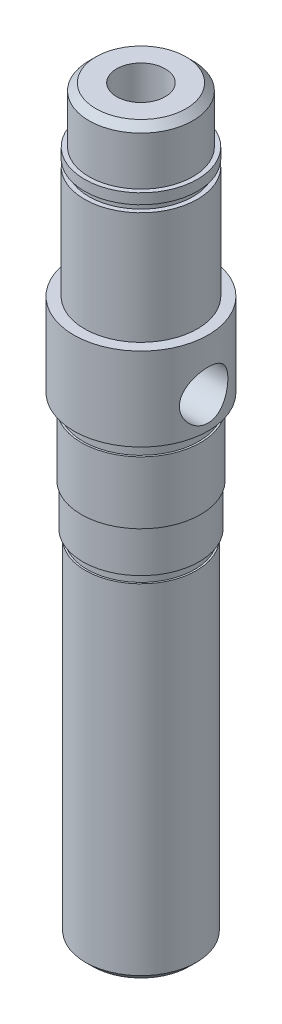
ISO-10303-21;
HEADER;
FILE_DESCRIPTION(('STEP AP214'),'2;1');
FILE_NAME('part.step','',(''),(''),'','','');
FILE_SCHEMA(('AUTOMOTIVE_DESIGN { 1 0 10303 214 1 1 1 1 }'));
ENDSEC;
DATA;
#1=APPLICATION_CONTEXT('core data for automotive mechanical design processes');
#2=APPLICATION_PROTOCOL_DEFINITION('international standard','automotive_design',2000,#1);
#3=PRODUCT_CONTEXT('',#1,'mechanical');
#4=PRODUCT('Part','Part','',(#3));
#5=PRODUCT_RELATED_PRODUCT_CATEGORY('part','',(#4));
#6=PRODUCT_DEFINITION_FORMATION('','',#4);
#7=PRODUCT_DEFINITION_CONTEXT('part definition',#1,'design');
#8=PRODUCT_DEFINITION('design','',#6,#7);
#9=PRODUCT_DEFINITION_SHAPE('','',#8);
#10=(LENGTH_UNIT() NAMED_UNIT(*) SI_UNIT(.MILLI.,.METRE.));
#11=(NAMED_UNIT(*) PLANE_ANGLE_UNIT() SI_UNIT($,.RADIAN.));
#12=(NAMED_UNIT(*) SI_UNIT($,.STERADIAN.) SOLID_ANGLE_UNIT());
#13=UNCERTAINTY_MEASURE_WITH_UNIT(LENGTH_MEASURE(1.E-05),#10,'distance_accuracy_value','');
#14=(GEOMETRIC_REPRESENTATION_CONTEXT(3) GLOBAL_UNCERTAINTY_ASSIGNED_CONTEXT((#13)) GLOBAL_UNIT_ASSIGNED_CONTEXT((#10,
#11,#12)) REPRESENTATION_CONTEXT('',''));
#15=CARTESIAN_POINT('',(0.,0.,0.));
#16=DIRECTION('',(0.,0.,1.));
#17=DIRECTION('',(1.,0.,0.));
#18=AXIS2_PLACEMENT_3D('',#15,#16,#17);
#19=CARTESIAN_POINT('',(0.,107.,0.));
#20=DIRECTION('',(0.,1.,0.));
#21=DIRECTION('',(0.,0.,1.));
#22=AXIS2_PLACEMENT_3D('',#19,#20,#21);
#23=CYLINDRICAL_SURFACE('',#22,9.7);
#24=CARTESIAN_POINT('',(0.,68.3,0.));
#25=DIRECTION('',(0.,1.,0.));
#26=DIRECTION('',(0.,0.,1.));
#27=AXIS2_PLACEMENT_3D('',#24,#25,#26);
#28=CIRCLE('',#27,9.7);
#29=CARTESIAN_POINT('',(0.,68.3,9.7));
#30=VERTEX_POINT('',#29);
#31=EDGE_CURVE('E125',#30,#30,#28,.T.);
#32=ORIENTED_EDGE('',*,*,#31,.T.);
#33=EDGE_LOOP('',(#32));
#34=FACE_BOUND('',#33,.T.);
#35=CARTESIAN_POINT('',(0.,80.3,0.));
#36=DIRECTION('',(0.,1.,0.));
#37=DIRECTION('',(0.,0.,1.));
#38=AXIS2_PLACEMENT_3D('',#35,#36,#37);
#39=CIRCLE('',#38,9.7);
#40=CARTESIAN_POINT('',(0.,80.3,9.7));
#41=VERTEX_POINT('',#40);
#42=EDGE_CURVE('E122',#41,#41,#39,.T.);
#43=ORIENTED_EDGE('',*,*,#42,.F.);
#44=EDGE_LOOP('',(#43));
#45=FACE_BOUND('',#44,.T.);
#46=CARTESIAN_POINT('',(9.7,76.3,0.));
#47=CARTESIAN_POINT('',(9.70000326363208,76.3000044955306,-0.190048434312413));
#48=CARTESIAN_POINT('',(9.69436502310496,76.2844715213943,-0.380065060738042));
#49=CARTESIAN_POINT('',(9.67243340114104,76.2229796151586,-0.754447520469261));
#50=CARTESIAN_POINT('',(9.6561406602026,76.1770225120126,-0.938813692756118));
#51=CARTESIAN_POINT('',(9.61465656297397,76.056500360991,-1.29644341601968));
#52=CARTESIAN_POINT('',(9.58948158703399,75.9819879522946,-1.46972671546527));
#53=CARTESIAN_POINT('',(9.53276201569288,75.8067276163716,-1.80132810228594));
#54=CARTESIAN_POINT('',(9.50121585549874,75.7059732422301,-1.95964249917633));
#55=CARTESIAN_POINT('',(9.43363084003839,75.4768963511195,-2.26310684130997));
#56=CARTESIAN_POINT('',(9.39747147835585,75.347715125354,-2.40758151312234));
#57=CARTESIAN_POINT('',(9.32535229272255,75.0672750043416,-2.67335049376495));
#58=CARTESIAN_POINT('',(9.2893925260619,74.9160100793378,-2.79463845071457));
#59=CARTESIAN_POINT('',(9.22036932494171,74.589282473392,-3.01472760920259));
#60=CARTESIAN_POINT('',(9.18744978930663,74.4131620197553,-3.11260192105112));
#61=CARTESIAN_POINT('',(9.13009434964343,74.0455830371819,-3.27704413538523));
#62=CARTESIAN_POINT('',(9.10565534320794,73.8541301488788,-3.3436234895813));
#63=CARTESIAN_POINT('',(9.06930945422295,73.4690659544289,-3.44096614767453));
#64=CARTESIAN_POINT('',(9.05695599489681,73.2758220280291,-3.47301058915794));
#65=CARTESIAN_POINT('',(9.04486769860813,72.8863354900277,-3.50437996520875));
#66=CARTESIAN_POINT('',(9.04512813440671,72.6900940293584,-3.50371715728725));
#67=CARTESIAN_POINT('',(9.05785091249404,72.3116123435047,-3.47067569177911));
#68=CARTESIAN_POINT('',(9.06964442029104,72.1291937963775,-3.44003546231126));
#69=CARTESIAN_POINT('',(9.10299899622594,71.7722866266259,-3.3507694420784));
#70=CARTESIAN_POINT('',(9.12456142579761,71.5977991130309,-3.2921397505352));
#71=CARTESIAN_POINT('',(9.17545236904553,71.2580223962428,-3.14754158601287));
#72=CARTESIAN_POINT('',(9.20491367715409,71.0929552769824,-3.06110004294575));
#73=CARTESIAN_POINT('',(9.26823458396981,70.7791489752728,-2.86366099099152));
#74=CARTESIAN_POINT('',(9.30209561736307,70.6304151481907,-2.75265546381061));
#75=CARTESIAN_POINT('',(9.37295773274056,70.3438211342941,-2.50114692866622));
#76=CARTESIAN_POINT('',(9.41002348969878,70.2072025711136,-2.35924408032947));
#77=CARTESIAN_POINT('',(9.48130712611506,69.9593480232088,-2.05410244545163));
#78=CARTESIAN_POINT('',(9.51552463005577,69.8481153820406,-1.8908608528525));
#79=CARTESIAN_POINT('',(9.57784962624326,69.6529549876507,-1.54469787396443));
#80=CARTESIAN_POINT('',(9.60586933384917,69.5694120859784,-1.36154259916851));
#81=CARTESIAN_POINT('',(9.65199610066544,69.4347270107282,-0.982517762074592));
#82=CARTESIAN_POINT('',(9.67010722221703,69.383571557527,-0.786653447150329));
#83=CARTESIAN_POINT('',(9.69367649897002,69.3174340921615,-0.398241992693978));
#84=CARTESIAN_POINT('',(9.69971962647188,69.3007781665351,-0.206015067332783));
#85=CARTESIAN_POINT('',(9.70026094381358,69.2992756819393,0.178558142724519));
#86=CARTESIAN_POINT('',(9.69476147121017,69.314422682381,0.370904395368631));
#87=CARTESIAN_POINT('',(9.67322206396606,69.374803917233,0.743211618243393));
#88=CARTESIAN_POINT('',(9.65755795448175,69.4189660526467,0.923370432152372));
#89=CARTESIAN_POINT('',(9.6176399859743,69.5347375623733,1.27361485837229));
#90=CARTESIAN_POINT('',(9.59338501042671,69.6063505044701,1.44369915797884));
#91=CARTESIAN_POINT('',(9.53784534991105,69.7772213099272,1.77438230731065));
#92=CARTESIAN_POINT('',(9.50638018857487,69.8772081797726,1.93457324534963));
#93=CARTESIAN_POINT('',(9.43993371175233,70.1011541230601,2.23642059530887));
#94=CARTESIAN_POINT('',(9.40495117244505,70.2251215541498,2.37807051641664));
#95=CARTESIAN_POINT('',(9.33301253255255,70.501344890552,2.64674498418307));
#96=CARTESIAN_POINT('',(9.29605117578761,70.6547611009922,2.77257826584955));
#97=CARTESIAN_POINT('',(9.22617619324352,70.9812880031909,2.99691853154221));
#98=CARTESIAN_POINT('',(9.19326279613658,71.1543998065053,3.09542397219298));
#99=CARTESIAN_POINT('',(9.13542619130016,71.5162931309494,3.26218250914122));
#100=CARTESIAN_POINT('',(9.11051622041164,71.7050999676196,3.33038555899287));
#101=CARTESIAN_POINT('',(9.07211527346371,72.0926547206841,3.43363039976507));
#102=CARTESIAN_POINT('',(9.05861793659507,72.2913970340502,3.46869066403966));
#103=CARTESIAN_POINT('',(9.04537391578975,72.680382531402,3.50307251896356));
#104=CARTESIAN_POINT('',(9.04485315408342,72.8704231827226,3.50440605027261));
#105=CARTESIAN_POINT('',(9.05566130946437,73.2478661626803,3.47638016301811));
#106=CARTESIAN_POINT('',(9.06698926615892,73.4352687039005,3.44702323205678));
#107=CARTESIAN_POINT('',(9.09959684074913,73.7971741890099,3.35996972486521));
#108=CARTESIAN_POINT('',(9.12060861050414,73.9718862678548,3.3030339253056));
#109=CARTESIAN_POINT('',(9.1700792819177,74.3093939457707,3.16308828400569));
#110=CARTESIAN_POINT('',(9.19853999491781,74.4721866340935,3.08007209937613));
#111=CARTESIAN_POINT('',(9.26145596420581,74.7899862946857,2.88554358646493));
#112=CARTESIAN_POINT('',(9.29613822299486,74.9442089274945,2.77282405541366));
#113=CARTESIAN_POINT('',(9.36675222929969,75.2321957811959,2.52401650801083));
#114=CARTESIAN_POINT('',(9.40268435591504,75.3659537273147,2.38792135139043));
#115=CARTESIAN_POINT('',(9.47384591335729,75.6158145326139,2.08831076460616));
#116=CARTESIAN_POINT('',(9.5089564254182,75.7307441726914,1.92378450733773));
#117=CARTESIAN_POINT('',(9.57265097937597,75.9312473439185,1.57653817122));
#118=CARTESIAN_POINT('',(9.60123531746125,76.0168222074143,1.39381891859498));
#119=CARTESIAN_POINT('',(9.64889832770736,76.1564301569307,1.01291303744514));
#120=CARTESIAN_POINT('',(9.66785793269195,76.2100695080788,0.814566153396514));
#121=CARTESIAN_POINT('',(9.69340446232499,76.2818447031419,0.410798501658297));
#122=CARTESIAN_POINT('',(9.69999647307293,76.2999951417905,0.205380677258914));
#123=CARTESIAN_POINT('',(9.7,76.3,0.));
#124=B_SPLINE_CURVE_WITH_KNOTS('',3,(#46,#47,#48,#49,#50,#51,#52,#53,#54,#55,#56,#57,#58,#59,
#60,#61,#62,#63,#64,#65,#66,#67,#68,#69,#70,#71,#72,#73,#74,#75,#76,#77,#78,#79,#80,#81,#82,#83,
#84,#85,#86,#87,#88,#89,#90,#91,#92,#93,#94,#95,#96,#97,#98,#99,#100,#101,#102,#103,#104,#105,
#106,#107,#108,#109,#110,#111,#112,#113,#114,#115,#116,#117,#118,#119,#120,#121,#122,#123),
.UNSPECIFIED.,.T.,.F.,(4,2,2,2,2,2,2,2,2,2,2,2,2,2,2,2,2,2,2,2,2,2,2,2,2,2,2,2,2,2,2,2,2,2,2,2,
2,2,4),(0.,0.569388345410459,1.13874246502282,1.70705204038071,2.27550136537242,
2.86432632019842,3.45331235015006,4.06274682276192,4.67195811210805,5.25769676297937,
5.8432159015532,6.39667789415568,6.95021704304686,7.51371919542262,8.07740556093055,
8.67595822456505,9.27458967757422,9.88122288759437,10.4876072022281,11.063806383537,
11.639888886775,12.1957994262361,12.7517822419501,13.3235939071889,13.8956052190755,
14.4982838272857,15.1009964656292,15.704700857624,16.3080685539524,16.8753520908334,
17.4425896503562,17.995001162535,18.5475471282925,19.1274455926038,19.7075215075113,
20.315774937114,20.9240007558306,21.539577970193,22.1549019765539),.UNSPECIFIED.);
#125=CARTESIAN_POINT('',(9.7,76.3,0.));
#126=VERTEX_POINT('',#125);
#127=EDGE_CURVE('E165',#126,#126,#124,.T.);
#128=ORIENTED_EDGE('',*,*,#127,.T.);
#129=EDGE_LOOP('',(#128));
#130=FACE_BOUND('',#129,.T.);
#131=ADVANCED_FACE('F41',(#34,#45,#130),#23,.T.);
#132=CARTESIAN_POINT('',(0.,0.,0.));
#133=DIRECTION('',(0.,-1.,0.));
#134=DIRECTION('',(0.,0.,-1.));
#135=AXIS2_PLACEMENT_3D('',#132,#133,#134);
#136=PLANE('',#135);
#137=CARTESIAN_POINT('',(0.,0.,0.));
#138=DIRECTION('',(0.,-1.,0.));
#139=DIRECTION('',(0.,0.,-1.));
#140=AXIS2_PLACEMENT_3D('',#137,#138,#139);
#141=CIRCLE('',#140,4.49999999999999);
#142=CARTESIAN_POINT('',(0.,0.,-4.49999999999999));
#143=VERTEX_POINT('',#142);
#144=EDGE_CURVE('E11',#143,#143,#141,.F.);
#145=ORIENTED_EDGE('',*,*,#144,.T.);
#146=EDGE_LOOP('',(#145));
#147=FACE_BOUND('',#146,.T.);
#148=CARTESIAN_POINT('',(0.,0.,0.));
#149=DIRECTION('',(0.,1.,0.));
#150=DIRECTION('',(0.,0.,1.));
#151=AXIS2_PLACEMENT_3D('',#148,#149,#150);
#152=CIRCLE('',#151,7.);
#153=CARTESIAN_POINT('',(0.,0.,7.));
#154=VERTEX_POINT('',#153);
#155=EDGE_CURVE('E158',#154,#154,#152,.T.);
#156=ORIENTED_EDGE('',*,*,#155,.F.);
#157=EDGE_LOOP('',(#156));
#158=FACE_BOUND('',#157,.T.);
#159=ADVANCED_FACE('F236',(#147,#158),#136,.T.);
#160=CARTESIAN_POINT('',(0.,1.,0.));
#161=DIRECTION('',(0.,1.,0.));
#162=DIRECTION('',(0.,0.,1.));
#163=AXIS2_PLACEMENT_3D('',#160,#161,#162);
#164=CONICAL_SURFACE('',#163,8.00000000000003,0.78539816339746);
#165=ORIENTED_EDGE('',*,*,#155,.T.);
#166=EDGE_LOOP('',(#165));
#167=FACE_BOUND('',#166,.T.);
#168=CARTESIAN_POINT('',(0.,1.,0.));
#169=DIRECTION('',(0.,1.,0.));
#170=DIRECTION('',(0.,0.,1.));
#171=AXIS2_PLACEMENT_3D('',#168,#169,#170);
#172=CIRCLE('',#171,8.00000000000003);
#173=CARTESIAN_POINT('',(0.,1.,8.00000000000003));
#174=VERTEX_POINT('',#173);
#175=EDGE_CURVE('E155',#174,#174,#172,.T.);
#176=ORIENTED_EDGE('',*,*,#175,.F.);
#177=EDGE_LOOP('',(#176));
#178=FACE_BOUND('',#177,.T.);
#179=ADVANCED_FACE('F241',(#167,#178),#164,.T.);
#180=CARTESIAN_POINT('',(0.,107.,0.));
#181=DIRECTION('',(0.,1.,0.));
#182=DIRECTION('',(0.,0.,1.));
#183=AXIS2_PLACEMENT_3D('',#180,#181,#182);
#184=CYLINDRICAL_SURFACE('',#183,8.00000000000003);
#185=CARTESIAN_POINT('',(0.,2.69999999999999,0.));
#186=DIRECTION('',(0.,-1.,0.));
#187=DIRECTION('',(0.,0.,-1.));
#188=AXIS2_PLACEMENT_3D('',#185,#186,#187);
#189=CIRCLE('',#188,8.00000000000003);
#190=CARTESIAN_POINT('',(5.80947501931,2.7,-5.5));
#191=VERTEX_POINT('',#190);
#192=CARTESIAN_POINT('',(-5.80947501931116,2.70000000000001,-5.5));
#193=VERTEX_POINT('',#192);
#194=EDGE_CURVE('E163',#191,#193,#189,.F.);
#195=ORIENTED_EDGE('',*,*,#194,.F.);
#196=DIRECTION('',(0.,1.,0.));
#197=VECTOR('',#196,1.);
#198=CARTESIAN_POINT('',(5.80947501931,2.7,-5.5));
#199=LINE('',#198,#197);
#200=CARTESIAN_POINT('',(5.80947501931,47.1,-5.5));
#201=VERTEX_POINT('',#200);
#202=EDGE_CURVE('E87',#191,#201,#199,.T.);
#203=ORIENTED_EDGE('',*,*,#202,.T.);
#204=CARTESIAN_POINT('',(0.,47.1,0.));
#205=DIRECTION('',(0.,1.,0.));
#206=DIRECTION('',(0.,0.,1.));
#207=AXIS2_PLACEMENT_3D('',#204,#205,#206);
#208=CIRCLE('',#207,8.00000000000003);
#209=CARTESIAN_POINT('',(-5.80947501931,47.1,-5.5));
#210=VERTEX_POINT('',#209);
#211=EDGE_CURVE('E161',#210,#201,#208,.F.);
#212=ORIENTED_EDGE('',*,*,#211,.F.);
#213=DIRECTION('',(0.,-1.,0.));
#214=VECTOR('',#213,1.);
#215=CARTESIAN_POINT('',(-5.80947501931,47.1,-5.5));
#216=LINE('',#215,#214);
#217=EDGE_CURVE('E92',#210,#193,#216,.T.);
#218=ORIENTED_EDGE('',*,*,#217,.T.);
#219=EDGE_LOOP('',(#195,#203,#212,#218));
#220=FACE_BOUND('',#219,.T.);
#221=ORIENTED_EDGE('',*,*,#175,.T.);
#222=EDGE_LOOP('',(#221));
#223=FACE_BOUND('',#222,.T.);
#224=CARTESIAN_POINT('',(0.,50.,0.));
#225=DIRECTION('',(0.,1.,0.));
#226=DIRECTION('',(0.,0.,1.));
#227=AXIS2_PLACEMENT_3D('',#224,#225,#226);
#228=CIRCLE('',#227,8.00000000000003);
#229=CARTESIAN_POINT('',(0.,50.,8.00000000000003));
#230=VERTEX_POINT('',#229);
#231=EDGE_CURVE('E152',#230,#230,#228,.T.);
#232=ORIENTED_EDGE('',*,*,#231,.F.);
#233=EDGE_LOOP('',(#232));
#234=FACE_BOUND('',#233,.T.);
#235=ADVANCED_FACE('F253',(#220,#223,#234),#184,.T.);
#236=CARTESIAN_POINT('',(-8.00000000000003,50.,0.));
#237=DIRECTION('',(0.,1.,0.));
#238=DIRECTION('',(0.,0.,1.));
#239=AXIS2_PLACEMENT_3D('',#236,#237,#238);
#240=PLANE('',#239);
#241=ORIENTED_EDGE('',*,*,#231,.T.);
#242=EDGE_LOOP('',(#241));
#243=FACE_BOUND('',#242,.T.);
#244=CARTESIAN_POINT('',(0.,50.,0.));
#245=DIRECTION('',(0.,1.,0.));
#246=DIRECTION('',(0.,0.,1.));
#247=AXIS2_PLACEMENT_3D('',#244,#245,#246);
#248=CIRCLE('',#247,7.75000000000003);
#249=CARTESIAN_POINT('',(0.,50.,7.75000000000003));
#250=VERTEX_POINT('',#249);
#251=EDGE_CURVE('E149',#250,#250,#248,.T.);
#252=ORIENTED_EDGE('',*,*,#251,.F.);
#253=EDGE_LOOP('',(#252));
#254=FACE_BOUND('',#253,.T.);
#255=ADVANCED_FACE('F260',(#243,#254),#240,.T.);
#256=CARTESIAN_POINT('',(0.,107.,0.));
#257=DIRECTION('',(0.,1.,0.));
#258=DIRECTION('',(0.,0.,1.));
#259=AXIS2_PLACEMENT_3D('',#256,#257,#258);
#260=CYLINDRICAL_SURFACE('',#259,7.75000000000003);
#261=ORIENTED_EDGE('',*,*,#251,.T.);
#262=EDGE_LOOP('',(#261));
#263=FACE_BOUND('',#262,.T.);
#264=CARTESIAN_POINT('',(0.,51.3,0.));
#265=DIRECTION('',(0.,1.,0.));
#266=DIRECTION('',(0.,0.,1.));
#267=AXIS2_PLACEMENT_3D('',#264,#265,#266);
#268=CIRCLE('',#267,7.75000000000003);
#269=CARTESIAN_POINT('',(0.,51.3,7.75000000000003));
#270=VERTEX_POINT('',#269);
#271=EDGE_CURVE('E146',#270,#270,#268,.T.);
#272=ORIENTED_EDGE('',*,*,#271,.F.);
#273=EDGE_LOOP('',(#272));
#274=FACE_BOUND('',#273,.T.);
#275=ADVANCED_FACE('F264',(#263,#274),#260,.T.);
#276=CARTESIAN_POINT('',(-7.75000000000003,51.3,0.));
#277=DIRECTION('',(0.,-1.,0.));
#278=DIRECTION('',(0.,0.,-1.));
#279=AXIS2_PLACEMENT_3D('',#276,#277,#278);
#280=PLANE('',#279);
#281=ORIENTED_EDGE('',*,*,#271,.T.);
#282=EDGE_LOOP('',(#281));
#283=FACE_BOUND('',#282,.T.);
#284=CARTESIAN_POINT('',(0.,51.3,0.));
#285=DIRECTION('',(0.,1.,0.));
#286=DIRECTION('',(0.,0.,1.));
#287=AXIS2_PLACEMENT_3D('',#284,#285,#286);
#288=CIRCLE('',#287,8.40000000000003);
#289=CARTESIAN_POINT('',(0.,51.3,8.40000000000003));
#290=VERTEX_POINT('',#289);
#291=EDGE_CURVE('E143',#290,#290,#288,.T.);
#292=ORIENTED_EDGE('',*,*,#291,.F.);
#293=EDGE_LOOP('',(#292));
#294=FACE_BOUND('',#293,.T.);
#295=ADVANCED_FACE('F268',(#283,#294),#280,.T.);
#296=CARTESIAN_POINT('',(0.,107.,0.));
#297=DIRECTION('',(0.,1.,0.));
#298=DIRECTION('',(0.,0.,1.));
#299=AXIS2_PLACEMENT_3D('',#296,#297,#298);
#300=CYLINDRICAL_SURFACE('',#299,8.40000000000001);
#301=ORIENTED_EDGE('',*,*,#291,.T.);
#302=EDGE_LOOP('',(#301));
#303=FACE_BOUND('',#302,.T.);
#304=CARTESIAN_POINT('',(0.,57.3,0.));
#305=DIRECTION('',(0.,1.,0.));
#306=DIRECTION('',(0.,0.,1.));
#307=AXIS2_PLACEMENT_3D('',#304,#305,#306);
#308=CIRCLE('',#307,8.39999999999999);
#309=CARTESIAN_POINT('',(0.,57.3,8.39999999999999));
#310=VERTEX_POINT('',#309);
#311=EDGE_CURVE('E140',#310,#310,#308,.T.);
#312=ORIENTED_EDGE('',*,*,#311,.F.);
#313=EDGE_LOOP('',(#312));
#314=FACE_BOUND('',#313,.T.);
#315=ADVANCED_FACE('F272',(#303,#314),#300,.T.);
#316=CARTESIAN_POINT('',(-8.39999999999999,57.3,0.));
#317=DIRECTION('',(0.,-1.,0.));
#318=DIRECTION('',(0.,0.,-1.));
#319=AXIS2_PLACEMENT_3D('',#316,#317,#318);
#320=PLANE('',#319);
#321=ORIENTED_EDGE('',*,*,#311,.T.);
#322=EDGE_LOOP('',(#321));
#323=FACE_BOUND('',#322,.T.);
#324=CARTESIAN_POINT('',(0.,57.3,0.));
#325=DIRECTION('',(0.,1.,0.));
#326=DIRECTION('',(0.,0.,1.));
#327=AXIS2_PLACEMENT_3D('',#324,#325,#326);
#328=CIRCLE('',#327,8.59999999999999);
#329=CARTESIAN_POINT('',(0.,57.3,8.59999999999999));
#330=VERTEX_POINT('',#329);
#331=EDGE_CURVE('E137',#330,#330,#328,.T.);
#332=ORIENTED_EDGE('',*,*,#331,.F.);
#333=EDGE_LOOP('',(#332));
#334=FACE_BOUND('',#333,.T.);
#335=ADVANCED_FACE('F276',(#323,#334),#320,.T.);
#336=CARTESIAN_POINT('',(0.,107.,0.));
#337=DIRECTION('',(0.,1.,0.));
#338=DIRECTION('',(0.,0.,1.));
#339=AXIS2_PLACEMENT_3D('',#336,#337,#338);
#340=CYLINDRICAL_SURFACE('',#339,8.59999999999999);
#341=ORIENTED_EDGE('',*,*,#331,.T.);
#342=EDGE_LOOP('',(#341));
#343=FACE_BOUND('',#342,.T.);
#344=CARTESIAN_POINT('',(0.,66.3,0.));
#345=DIRECTION('',(0.,1.,0.));
#346=DIRECTION('',(0.,0.,1.));
#347=AXIS2_PLACEMENT_3D('',#344,#345,#346);
#348=CIRCLE('',#347,8.59999999999999);
#349=CARTESIAN_POINT('',(0.,66.3,8.59999999999999));
#350=VERTEX_POINT('',#349);
#351=EDGE_CURVE('E134',#350,#350,#348,.T.);
#352=ORIENTED_EDGE('',*,*,#351,.F.);
#353=EDGE_LOOP('',(#352));
#354=FACE_BOUND('',#353,.T.);
#355=ADVANCED_FACE('F280',(#343,#354),#340,.T.);
#356=CARTESIAN_POINT('',(-8.59999999999999,66.3,0.));
#357=DIRECTION('',(0.,1.,0.));
#358=DIRECTION('',(0.,0.,1.));
#359=AXIS2_PLACEMENT_3D('',#356,#357,#358);
#360=PLANE('',#359);
#361=ORIENTED_EDGE('',*,*,#351,.T.);
#362=EDGE_LOOP('',(#361));
#363=FACE_BOUND('',#362,.T.);
#364=CARTESIAN_POINT('',(0.,66.3,0.));
#365=DIRECTION('',(0.,1.,0.));
#366=DIRECTION('',(0.,0.,1.));
#367=AXIS2_PLACEMENT_3D('',#364,#365,#366);
#368=CIRCLE('',#367,8.32999999999999);
#369=CARTESIAN_POINT('',(0.,66.3,8.32999999999999));
#370=VERTEX_POINT('',#369);
#371=EDGE_CURVE('E131',#370,#370,#368,.T.);
#372=ORIENTED_EDGE('',*,*,#371,.F.);
#373=EDGE_LOOP('',(#372));
#374=FACE_BOUND('',#373,.T.);
#375=ADVANCED_FACE('F284',(#363,#374),#360,.T.);
#376=CARTESIAN_POINT('',(0.,107.,0.));
#377=DIRECTION('',(0.,1.,0.));
#378=DIRECTION('',(0.,0.,1.));
#379=AXIS2_PLACEMENT_3D('',#376,#377,#378);
#380=CYLINDRICAL_SURFACE('',#379,8.32999999999999);
#381=ORIENTED_EDGE('',*,*,#371,.T.);
#382=EDGE_LOOP('',(#381));
#383=FACE_BOUND('',#382,.T.);
#384=CARTESIAN_POINT('',(0.,68.3,0.));
#385=DIRECTION('',(0.,1.,0.));
#386=DIRECTION('',(0.,0.,1.));
#387=AXIS2_PLACEMENT_3D('',#384,#385,#386);
#388=CIRCLE('',#387,8.32999999999999);
#389=CARTESIAN_POINT('',(0.,68.3,8.32999999999999));
#390=VERTEX_POINT('',#389);
#391=EDGE_CURVE('E128',#390,#390,#388,.T.);
#392=ORIENTED_EDGE('',*,*,#391,.F.);
#393=EDGE_LOOP('',(#392));
#394=FACE_BOUND('',#393,.T.);
#395=ADVANCED_FACE('F232',(#383,#394),#380,.T.);
#396=CARTESIAN_POINT('',(-8.32999999999999,68.3,0.));
#397=DIRECTION('',(0.,-1.,0.));
#398=DIRECTION('',(0.,0.,-1.));
#399=AXIS2_PLACEMENT_3D('',#396,#397,#398);
#400=PLANE('',#399);
#401=ORIENTED_EDGE('',*,*,#391,.T.);
#402=EDGE_LOOP('',(#401));
#403=FACE_BOUND('',#402,.T.);
#404=ORIENTED_EDGE('',*,*,#31,.F.);
#405=EDGE_LOOP('',(#404));
#406=FACE_BOUND('',#405,.T.);
#407=ADVANCED_FACE('F227',(#403,#406),#400,.T.);
#408=CARTESIAN_POINT('',(-9.7,80.3,0.));
#409=DIRECTION('',(0.,1.,0.));
#410=DIRECTION('',(0.,0.,1.));
#411=AXIS2_PLACEMENT_3D('',#408,#409,#410);
#412=PLANE('',#411);
#413=ORIENTED_EDGE('',*,*,#42,.T.);
#414=EDGE_LOOP('',(#413));
#415=FACE_BOUND('',#414,.T.);
#416=CARTESIAN_POINT('',(0.,80.3,0.));
#417=DIRECTION('',(0.,1.,0.));
#418=DIRECTION('',(0.,0.,1.));
#419=AXIS2_PLACEMENT_3D('',#416,#417,#418);
#420=CIRCLE('',#419,8.15);
#421=CARTESIAN_POINT('',(0.,80.3,8.15));
#422=VERTEX_POINT('',#421);
#423=EDGE_CURVE('E119',#422,#422,#420,.T.);
#424=ORIENTED_EDGE('',*,*,#423,.F.);
#425=EDGE_LOOP('',(#424));
#426=FACE_BOUND('',#425,.T.);
#427=ADVANCED_FACE('F224',(#415,#426),#412,.T.);
#428=CARTESIAN_POINT('',(0.,107.,0.));
#429=DIRECTION('',(0.,1.,0.));
#430=DIRECTION('',(0.,0.,1.));
#431=AXIS2_PLACEMENT_3D('',#428,#429,#430);
#432=CYLINDRICAL_SURFACE('',#431,8.15);
#433=ORIENTED_EDGE('',*,*,#423,.T.);
#434=EDGE_LOOP('',(#433));
#435=FACE_BOUND('',#434,.T.);
#436=CARTESIAN_POINT('',(0.,96.5,0.));
#437=DIRECTION('',(0.,1.,0.));
#438=DIRECTION('',(0.,0.,1.));
#439=AXIS2_PLACEMENT_3D('',#436,#437,#438);
#440=CIRCLE('',#439,8.15);
#441=CARTESIAN_POINT('',(0.,96.5,8.15));
#442=VERTEX_POINT('',#441);
#443=EDGE_CURVE('E116',#442,#442,#440,.T.);
#444=ORIENTED_EDGE('',*,*,#443,.F.);
#445=EDGE_LOOP('',(#444));
#446=FACE_BOUND('',#445,.T.);
#447=ADVANCED_FACE('F221',(#435,#446),#432,.T.);
#448=CARTESIAN_POINT('',(-8.15,96.5,0.));
#449=DIRECTION('',(0.,1.,0.));
#450=DIRECTION('',(0.,0.,1.));
#451=AXIS2_PLACEMENT_3D('',#448,#449,#450);
#452=PLANE('',#451);
#453=ORIENTED_EDGE('',*,*,#443,.T.);
#454=EDGE_LOOP('',(#453));
#455=FACE_BOUND('',#454,.T.);
#456=CARTESIAN_POINT('',(0.,96.5,0.));
#457=DIRECTION('',(0.,1.,0.));
#458=DIRECTION('',(0.,0.,1.));
#459=AXIS2_PLACEMENT_3D('',#456,#457,#458);
#460=CIRCLE('',#459,7.5);
#461=CARTESIAN_POINT('',(0.,96.5,7.5));
#462=VERTEX_POINT('',#461);
#463=EDGE_CURVE('E113',#462,#462,#460,.T.);
#464=ORIENTED_EDGE('',*,*,#463,.F.);
#465=EDGE_LOOP('',(#464));
#466=FACE_BOUND('',#465,.T.);
#467=ADVANCED_FACE('F217',(#455,#466),#452,.T.);
#468=CARTESIAN_POINT('',(0.,107.,0.));
#469=DIRECTION('',(0.,1.,0.));
#470=DIRECTION('',(0.,0.,1.));
#471=AXIS2_PLACEMENT_3D('',#468,#469,#470);
#472=CYLINDRICAL_SURFACE('',#471,7.5);
#473=ORIENTED_EDGE('',*,*,#463,.T.);
#474=EDGE_LOOP('',(#473));
#475=FACE_BOUND('',#474,.T.);
#476=CARTESIAN_POINT('',(0.,97.5,0.));
#477=DIRECTION('',(0.,1.,0.));
#478=DIRECTION('',(0.,0.,1.));
#479=AXIS2_PLACEMENT_3D('',#476,#477,#478);
#480=CIRCLE('',#479,7.5);
#481=CARTESIAN_POINT('',(0.,97.5,7.5));
#482=VERTEX_POINT('',#481);
#483=EDGE_CURVE('E110',#482,#482,#480,.T.);
#484=ORIENTED_EDGE('',*,*,#483,.F.);
#485=EDGE_LOOP('',(#484));
#486=FACE_BOUND('',#485,.T.);
#487=ADVANCED_FACE('F213',(#475,#486),#472,.T.);
#488=CARTESIAN_POINT('',(-7.5,97.5,0.));
#489=DIRECTION('',(0.,-1.,0.));
#490=DIRECTION('',(0.,0.,-1.));
#491=AXIS2_PLACEMENT_3D('',#488,#489,#490);
#492=PLANE('',#491);
#493=ORIENTED_EDGE('',*,*,#483,.T.);
#494=EDGE_LOOP('',(#493));
#495=FACE_BOUND('',#494,.T.);
#496=CARTESIAN_POINT('',(0.,97.5,0.));
#497=DIRECTION('',(0.,1.,0.));
#498=DIRECTION('',(0.,0.,1.));
#499=AXIS2_PLACEMENT_3D('',#496,#497,#498);
#500=CIRCLE('',#499,8.15);
#501=CARTESIAN_POINT('',(0.,97.5,8.15));
#502=VERTEX_POINT('',#501);
#503=EDGE_CURVE('E107',#502,#502,#500,.T.);
#504=ORIENTED_EDGE('',*,*,#503,.F.);
#505=EDGE_LOOP('',(#504));
#506=FACE_BOUND('',#505,.T.);
#507=ADVANCED_FACE('F209',(#495,#506),#492,.T.);
#508=CARTESIAN_POINT('',(0.,107.,0.));
#509=DIRECTION('',(0.,1.,0.));
#510=DIRECTION('',(0.,0.,1.));
#511=AXIS2_PLACEMENT_3D('',#508,#509,#510);
#512=CYLINDRICAL_SURFACE('',#511,8.15);
#513=ORIENTED_EDGE('',*,*,#503,.T.);
#514=EDGE_LOOP('',(#513));
#515=FACE_BOUND('',#514,.T.);
#516=CARTESIAN_POINT('',(0.,99.,0.));
#517=DIRECTION('',(0.,1.,0.));
#518=DIRECTION('',(0.,0.,1.));
#519=AXIS2_PLACEMENT_3D('',#516,#517,#518);
#520=CIRCLE('',#519,8.15);
#521=CARTESIAN_POINT('',(0.,99.,8.15));
#522=VERTEX_POINT('',#521);
#523=EDGE_CURVE('E104',#522,#522,#520,.T.);
#524=ORIENTED_EDGE('',*,*,#523,.F.);
#525=EDGE_LOOP('',(#524));
#526=FACE_BOUND('',#525,.T.);
#527=ADVANCED_FACE('F205',(#515,#526),#512,.T.);
#528=CARTESIAN_POINT('',(-8.15,99.,0.));
#529=DIRECTION('',(0.,1.,0.));
#530=DIRECTION('',(0.,0.,1.));
#531=AXIS2_PLACEMENT_3D('',#528,#529,#530);
#532=PLANE('',#531);
#533=ORIENTED_EDGE('',*,*,#523,.T.);
#534=EDGE_LOOP('',(#533));
#535=FACE_BOUND('',#534,.T.);
#536=CARTESIAN_POINT('',(0.,99.,0.));
#537=DIRECTION('',(0.,1.,0.));
#538=DIRECTION('',(0.,0.,1.));
#539=AXIS2_PLACEMENT_3D('',#536,#537,#538);
#540=CIRCLE('',#539,7.5);
#541=CARTESIAN_POINT('',(0.,99.,7.5));
#542=VERTEX_POINT('',#541);
#543=EDGE_CURVE('E101',#542,#542,#540,.T.);
#544=ORIENTED_EDGE('',*,*,#543,.F.);
#545=EDGE_LOOP('',(#544));
#546=FACE_BOUND('',#545,.T.);
#547=ADVANCED_FACE('F201',(#535,#546),#532,.T.);
#548=CARTESIAN_POINT('',(0.,107.,0.));
#549=DIRECTION('',(0.,1.,0.));
#550=DIRECTION('',(0.,0.,1.));
#551=AXIS2_PLACEMENT_3D('',#548,#549,#550);
#552=CYLINDRICAL_SURFACE('',#551,7.5);
#553=ORIENTED_EDGE('',*,*,#543,.T.);
#554=EDGE_LOOP('',(#553));
#555=FACE_BOUND('',#554,.T.);
#556=CARTESIAN_POINT('',(0.,106.,0.));
#557=DIRECTION('',(0.,1.,0.));
#558=DIRECTION('',(0.,0.,1.));
#559=AXIS2_PLACEMENT_3D('',#556,#557,#558);
#560=CIRCLE('',#559,7.5);
#561=CARTESIAN_POINT('',(0.,106.,7.5));
#562=VERTEX_POINT('',#561);
#563=EDGE_CURVE('E98',#562,#562,#560,.T.);
#564=ORIENTED_EDGE('',*,*,#563,.F.);
#565=EDGE_LOOP('',(#564));
#566=FACE_BOUND('',#565,.T.);
#567=ADVANCED_FACE('F197',(#555,#566),#552,.T.);
#568=CARTESIAN_POINT('',(0.,107.,0.));
#569=DIRECTION('',(0.,-1.,0.));
#570=DIRECTION('',(0.,0.,-1.));
#571=AXIS2_PLACEMENT_3D('',#568,#569,#570);
#572=CONICAL_SURFACE('',#571,6.5,0.785398163397447);
#573=ORIENTED_EDGE('',*,*,#563,.T.);
#574=EDGE_LOOP('',(#573));
#575=FACE_BOUND('',#574,.T.);
#576=CARTESIAN_POINT('',(0.,107.,0.));
#577=DIRECTION('',(0.,1.,0.));
#578=DIRECTION('',(0.,0.,1.));
#579=AXIS2_PLACEMENT_3D('',#576,#577,#578);
#580=CIRCLE('',#579,6.5);
#581=CARTESIAN_POINT('',(0.,107.,6.5));
#582=VERTEX_POINT('',#581);
#583=EDGE_CURVE('E95',#582,#582,#580,.T.);
#584=ORIENTED_EDGE('',*,*,#583,.F.);
#585=EDGE_LOOP('',(#584));
#586=FACE_BOUND('',#585,.T.);
#587=ADVANCED_FACE('F193',(#575,#586),#572,.T.);
#588=CARTESIAN_POINT('',(-6.5,107.,0.));
#589=DIRECTION('',(0.,1.,0.));
#590=DIRECTION('',(0.,0.,1.));
#591=AXIS2_PLACEMENT_3D('',#588,#589,#590);
#592=PLANE('',#591);
#593=CARTESIAN_POINT('',(0.,107.,0.));
#594=DIRECTION('',(0.,1.,0.));
#595=DIRECTION('',(0.,0.,1.));
#596=AXIS2_PLACEMENT_3D('',#593,#594,#595);
#597=CIRCLE('',#596,3.5);
#598=CARTESIAN_POINT('',(0.,107.,3.5));
#599=VERTEX_POINT('',#598);
#600=EDGE_CURVE('E81',#599,#599,#597,.T.);
#601=ORIENTED_EDGE('',*,*,#600,.F.);
#602=EDGE_LOOP('',(#601));
#603=FACE_BOUND('',#602,.T.);
#604=ORIENTED_EDGE('',*,*,#583,.T.);
#605=EDGE_LOOP('',(#604));
#606=FACE_BOUND('',#605,.T.);
#607=ADVANCED_FACE('F189',(#603,#606),#592,.T.);
#608=CARTESIAN_POINT('',(-5.80947501931,2.7,-9.7));
#609=DIRECTION('',(0.,-1.,0.));
#610=DIRECTION('',(0.,0.,-1.));
#611=AXIS2_PLACEMENT_3D('',#608,#609,#610);
#612=PLANE('',#611);
#613=ORIENTED_EDGE('',*,*,#194,.T.);
#614=DIRECTION('',(1.,0.,0.));
#615=VECTOR('',#614,1.);
#616=CARTESIAN_POINT('',(-5.80947501931,2.7,-5.5));
#617=LINE('',#616,#615);
#618=EDGE_CURVE('E64',#193,#191,#617,.T.);
#619=ORIENTED_EDGE('',*,*,#618,.T.);
#620=EDGE_LOOP('',(#613,#619));
#621=FACE_BOUND('',#620,.T.);
#622=ADVANCED_FACE('F185',(#621),#612,.F.);
#623=CARTESIAN_POINT('',(5.80947501931,47.1,-9.7));
#624=DIRECTION('',(0.,1.,0.));
#625=DIRECTION('',(0.,0.,1.));
#626=AXIS2_PLACEMENT_3D('',#623,#624,#625);
#627=PLANE('',#626);
#628=ORIENTED_EDGE('',*,*,#211,.T.);
#629=DIRECTION('',(-1.,0.,0.));
#630=VECTOR('',#629,1.);
#631=CARTESIAN_POINT('',(5.80947501931,47.1,-5.5));
#632=LINE('',#631,#630);
#633=EDGE_CURVE('E90',#201,#210,#632,.T.);
#634=ORIENTED_EDGE('',*,*,#633,.T.);
#635=EDGE_LOOP('',(#628,#634));
#636=FACE_BOUND('',#635,.T.);
#637=ADVANCED_FACE('F182',(#636),#627,.F.);
#638=CARTESIAN_POINT('',(0.,0.,-5.5));
#639=DIRECTION('',(0.,0.,1.));
#640=DIRECTION('',(1.,0.,0.));
#641=AXIS2_PLACEMENT_3D('',#638,#639,#640);
#642=PLANE('',#641);
#643=ORIENTED_EDGE('',*,*,#618,.F.);
#644=ORIENTED_EDGE('',*,*,#217,.F.);
#645=ORIENTED_EDGE('',*,*,#633,.F.);
#646=ORIENTED_EDGE('',*,*,#202,.F.);
#647=EDGE_LOOP('',(#643,#644,#645,#646));
#648=FACE_BOUND('',#647,.T.);
#649=ADVANCED_FACE('F179',(#648),#642,.F.);
#650=CARTESIAN_POINT('',(9.7,72.8,0.));
#651=DIRECTION('',(-1.,0.,0.));
#652=DIRECTION('',(0.,0.,1.));
#653=AXIS2_PLACEMENT_3D('',#650,#651,#652);
#654=CYLINDRICAL_SURFACE('',#653,3.5);
#655=CARTESIAN_POINT('',(0.,72.8,0.));
#656=DIRECTION('',(-0.707106781186547,-0.707106781186547,0.));
#657=DIRECTION('',(-0.707106781186547,0.707106781186547,0.));
#658=AXIS2_PLACEMENT_3D('',#655,#656,#657);
#659=ELLIPSE('',#658,4.94974746830583,3.5);
#660=CARTESIAN_POINT('',(0.,72.8,3.5));
#661=VERTEX_POINT('',#660);
#662=CARTESIAN_POINT('',(0.,72.8,-3.5));
#663=VERTEX_POINT('',#662);
#664=EDGE_CURVE('E56',#661,#663,#659,.F.);
#665=ORIENTED_EDGE('',*,*,#664,.F.);
#666=CARTESIAN_POINT('',(0.,72.8,0.));
#667=DIRECTION('',(-0.707106781186547,0.707106781186547,0.));
#668=DIRECTION('',(-0.707106781186547,-0.707106781186547,0.));
#669=AXIS2_PLACEMENT_3D('',#666,#667,#668);
#670=ELLIPSE('',#669,4.94974746830583,3.5);
#671=EDGE_CURVE('E75',#663,#661,#670,.F.);
#672=ORIENTED_EDGE('',*,*,#671,.F.);
#673=EDGE_LOOP('',(#665,#672));
#674=FACE_BOUND('',#673,.T.);
#675=ORIENTED_EDGE('',*,*,#127,.F.);
#676=EDGE_LOOP('',(#675));
#677=FACE_BOUND('',#676,.T.);
#678=ADVANCED_FACE('F79',(#674,#677),#654,.F.);
#679=CARTESIAN_POINT('',(0.,120.,0.));
#680=DIRECTION('',(0.,-1.,0.));
#681=DIRECTION('',(0.,0.,-1.));
#682=AXIS2_PLACEMENT_3D('',#679,#680,#681);
#683=CYLINDRICAL_SURFACE('',#682,3.5);
#684=CARTESIAN_POINT('',(0.,0.999999999999987,0.));
#685=DIRECTION('',(0.,-1.,0.));
#686=DIRECTION('',(0.,0.,-1.));
#687=AXIS2_PLACEMENT_3D('',#684,#685,#686);
#688=CIRCLE('',#687,3.5);
#689=CARTESIAN_POINT('',(0.,0.999999999999987,-3.5));
#690=VERTEX_POINT('',#689);
#691=EDGE_CURVE('E50',#690,#690,#688,.T.);
#692=ORIENTED_EDGE('',*,*,#691,.T.);
#693=EDGE_LOOP('',(#692));
#694=FACE_BOUND('',#693,.T.);
#695=ORIENTED_EDGE('',*,*,#600,.T.);
#696=EDGE_LOOP('',(#695));
#697=FACE_BOUND('',#696,.T.);
#698=ORIENTED_EDGE('',*,*,#664,.T.);
#699=ORIENTED_EDGE('',*,*,#671,.T.);
#700=EDGE_LOOP('',(#698,#699));
#701=FACE_BOUND('',#700,.T.);
#702=ADVANCED_FACE('F76',(#694,#697,#701),#683,.F.);
#703=CARTESIAN_POINT('',(0.,0.999999999999987,0.));
#704=DIRECTION('',(0.,-1.,0.));
#705=DIRECTION('',(0.,0.,-1.));
#706=AXIS2_PLACEMENT_3D('',#703,#704,#705);
#707=CONICAL_SURFACE('',#706,3.5,0.78539816339745);
#708=ORIENTED_EDGE('',*,*,#144,.F.);
#709=EDGE_LOOP('',(#708));
#710=FACE_BOUND('',#709,.T.);
#711=ORIENTED_EDGE('',*,*,#691,.F.);
#712=EDGE_LOOP('',(#711));
#713=FACE_BOUND('',#712,.T.);
#714=ADVANCED_FACE('F44',(#710,#713),#707,.F.);
#715=CLOSED_SHELL('',(#131,#159,#179,#235,#255,#275,#295,#315,#335,#355,#375,#395,#407,#427,
#447,#467,#487,#507,#527,#547,#567,#587,#607,#622,#637,#649,#678,#702,#714));
#716=MANIFOLD_SOLID_BREP('B2',#715);
#717=ADVANCED_BREP_SHAPE_REPRESENTATION('',(#18,#716),#14);
#718=SHAPE_DEFINITION_REPRESENTATION(#9,#717);
ENDSEC;
END-ISO-10303-21;
